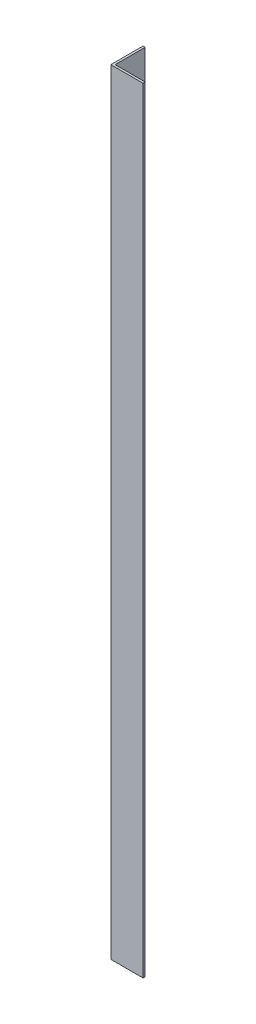
ISO-10303-21;
HEADER;
FILE_DESCRIPTION(('STEP AP214'),'2;1');
FILE_NAME('part.step','',(''),(''),'','','');
FILE_SCHEMA(('AUTOMOTIVE_DESIGN { 1 0 10303 214 1 1 1 1 }'));
ENDSEC;
DATA;
#1=APPLICATION_CONTEXT('core data for automotive mechanical design processes');
#2=APPLICATION_PROTOCOL_DEFINITION('international standard','automotive_design',2000,#1);
#3=PRODUCT_CONTEXT('',#1,'mechanical');
#4=PRODUCT('Part','Part','',(#3));
#5=PRODUCT_RELATED_PRODUCT_CATEGORY('part','',(#4));
#6=PRODUCT_DEFINITION_FORMATION('','',#4);
#7=PRODUCT_DEFINITION_CONTEXT('part definition',#1,'design');
#8=PRODUCT_DEFINITION('design','',#6,#7);
#9=PRODUCT_DEFINITION_SHAPE('','',#8);
#10=(LENGTH_UNIT() NAMED_UNIT(*) SI_UNIT(.MILLI.,.METRE.));
#11=(NAMED_UNIT(*) PLANE_ANGLE_UNIT() SI_UNIT($,.RADIAN.));
#12=(NAMED_UNIT(*) SI_UNIT($,.STERADIAN.) SOLID_ANGLE_UNIT());
#13=UNCERTAINTY_MEASURE_WITH_UNIT(LENGTH_MEASURE(1.E-05),#10,'distance_accuracy_value','');
#14=(GEOMETRIC_REPRESENTATION_CONTEXT(3) GLOBAL_UNCERTAINTY_ASSIGNED_CONTEXT((#13)) GLOBAL_UNIT_ASSIGNED_CONTEXT((#10,
#11,#12)) REPRESENTATION_CONTEXT('',''));
#15=CARTESIAN_POINT('',(0.,0.,0.));
#16=DIRECTION('',(0.,0.,1.));
#17=DIRECTION('',(1.,0.,0.));
#18=AXIS2_PLACEMENT_3D('',#15,#16,#17);
#19=CARTESIAN_POINT('',(15.,360.,0.));
#20=DIRECTION('',(0.,0.,-1.));
#21=DIRECTION('',(-1.,0.,0.));
#22=AXIS2_PLACEMENT_3D('',#19,#20,#21);
#23=PLANE('',#22);
#24=DIRECTION('',(1.,0.,0.));
#25=VECTOR('',#24,1.);
#26=CARTESIAN_POINT('',(15.,0.,0.));
#27=LINE('',#26,#25);
#28=CARTESIAN_POINT('',(0.,0.,0.));
#29=VERTEX_POINT('',#28);
#30=CARTESIAN_POINT('',(15.,0.,0.));
#31=VERTEX_POINT('',#30);
#32=EDGE_CURVE('E121',#29,#31,#27,.T.);
#33=ORIENTED_EDGE('',*,*,#32,.T.);
#34=DIRECTION('',(0.,-1.,0.));
#35=VECTOR('',#34,1.);
#36=CARTESIAN_POINT('',(15.,360.,0.));
#37=LINE('',#36,#35);
#38=CARTESIAN_POINT('',(15.,360.,0.));
#39=VERTEX_POINT('',#38);
#40=EDGE_CURVE('E11',#39,#31,#37,.T.);
#41=ORIENTED_EDGE('',*,*,#40,.F.);
#42=DIRECTION('',(1.,0.,0.));
#43=VECTOR('',#42,1.);
#44=CARTESIAN_POINT('',(15.,360.,0.));
#45=LINE('',#44,#43);
#46=CARTESIAN_POINT('',(0.,360.,0.));
#47=VERTEX_POINT('',#46);
#48=EDGE_CURVE('E131',#47,#39,#45,.T.);
#49=ORIENTED_EDGE('',*,*,#48,.F.);
#50=DIRECTION('',(0.,-1.,0.));
#51=VECTOR('',#50,1.);
#52=CARTESIAN_POINT('',(0.,360.,0.));
#53=LINE('',#52,#51);
#54=EDGE_CURVE('E117',#47,#29,#53,.T.);
#55=ORIENTED_EDGE('',*,*,#54,.T.);
#56=EDGE_LOOP('',(#33,#41,#49,#55));
#57=FACE_BOUND('',#56,.T.);
#58=ADVANCED_FACE('F37',(#57),#23,.F.);
#59=CARTESIAN_POINT('',(15.,360.,-0.999999999999998));
#60=DIRECTION('',(-1.,0.,0.));
#61=DIRECTION('',(0.,0.,1.));
#62=AXIS2_PLACEMENT_3D('',#59,#60,#61);
#63=PLANE('',#62);
#64=DIRECTION('',(0.,0.,-1.));
#65=VECTOR('',#64,1.);
#66=CARTESIAN_POINT('',(15.,0.,-0.999999999999998));
#67=LINE('',#66,#65);
#68=CARTESIAN_POINT('',(15.,0.,-0.999999999999998));
#69=VERTEX_POINT('',#68);
#70=EDGE_CURVE('E124',#31,#69,#67,.T.);
#71=ORIENTED_EDGE('',*,*,#70,.T.);
#72=DIRECTION('',(0.,-1.,0.));
#73=VECTOR('',#72,1.);
#74=CARTESIAN_POINT('',(15.,360.,-0.999999999999998));
#75=LINE('',#74,#73);
#76=CARTESIAN_POINT('',(15.,360.,-0.999999999999998));
#77=VERTEX_POINT('',#76);
#78=EDGE_CURVE('E45',#77,#69,#75,.T.);
#79=ORIENTED_EDGE('',*,*,#78,.F.);
#80=DIRECTION('',(0.,0.,-1.));
#81=VECTOR('',#80,1.);
#82=CARTESIAN_POINT('',(15.,360.,-0.999999999999998));
#83=LINE('',#82,#81);
#84=EDGE_CURVE('E90',#39,#77,#83,.T.);
#85=ORIENTED_EDGE('',*,*,#84,.F.);
#86=ORIENTED_EDGE('',*,*,#40,.T.);
#87=EDGE_LOOP('',(#71,#79,#85,#86));
#88=FACE_BOUND('',#87,.T.);
#89=ADVANCED_FACE('F155',(#88),#63,.F.);
#90=CARTESIAN_POINT('',(1.,360.,-0.999999999999997));
#91=DIRECTION('',(0.,0.,1.));
#92=DIRECTION('',(1.,0.,0.));
#93=AXIS2_PLACEMENT_3D('',#90,#91,#92);
#94=PLANE('',#93);
#95=DIRECTION('',(-1.,0.,0.));
#96=VECTOR('',#95,1.);
#97=CARTESIAN_POINT('',(1.,0.,-0.999999999999997));
#98=LINE('',#97,#96);
#99=CARTESIAN_POINT('',(1.,0.,-0.999999999999997));
#100=VERTEX_POINT('',#99);
#101=EDGE_CURVE('E126',#69,#100,#98,.T.);
#102=ORIENTED_EDGE('',*,*,#101,.T.);
#103=DIRECTION('',(0.,-1.,0.));
#104=VECTOR('',#103,1.);
#105=CARTESIAN_POINT('',(1.,360.,-0.999999999999997));
#106=LINE('',#105,#104);
#107=CARTESIAN_POINT('',(1.,360.,-0.999999999999997));
#108=VERTEX_POINT('',#107);
#109=EDGE_CURVE('E112',#108,#100,#106,.T.);
#110=ORIENTED_EDGE('',*,*,#109,.F.);
#111=DIRECTION('',(-1.,0.,0.));
#112=VECTOR('',#111,1.);
#113=CARTESIAN_POINT('',(1.,360.,-0.999999999999997));
#114=LINE('',#113,#112);
#115=EDGE_CURVE('E103',#77,#108,#114,.T.);
#116=ORIENTED_EDGE('',*,*,#115,.F.);
#117=ORIENTED_EDGE('',*,*,#78,.T.);
#118=EDGE_LOOP('',(#102,#110,#116,#117));
#119=FACE_BOUND('',#118,.T.);
#120=ADVANCED_FACE('F137',(#119),#94,.F.);
#121=CARTESIAN_POINT('',(0.999999999999998,360.,-15.));
#122=DIRECTION('',(-1.,0.,0.));
#123=DIRECTION('',(0.,0.,1.));
#124=AXIS2_PLACEMENT_3D('',#121,#122,#123);
#125=PLANE('',#124);
#126=DIRECTION('',(0.,0.,-1.));
#127=VECTOR('',#126,1.);
#128=CARTESIAN_POINT('',(0.999999999999998,0.,-15.));
#129=LINE('',#128,#127);
#130=CARTESIAN_POINT('',(0.999999999999998,0.,-15.));
#131=VERTEX_POINT('',#130);
#132=EDGE_CURVE('E111',#100,#131,#129,.T.);
#133=ORIENTED_EDGE('',*,*,#132,.T.);
#134=DIRECTION('',(0.,-1.,0.));
#135=VECTOR('',#134,1.);
#136=CARTESIAN_POINT('',(0.999999999999998,360.,-15.));
#137=LINE('',#136,#135);
#138=CARTESIAN_POINT('',(0.999999999999998,360.,-15.));
#139=VERTEX_POINT('',#138);
#140=EDGE_CURVE('E108',#139,#131,#137,.T.);
#141=ORIENTED_EDGE('',*,*,#140,.F.);
#142=DIRECTION('',(0.,0.,-1.));
#143=VECTOR('',#142,1.);
#144=CARTESIAN_POINT('',(0.999999999999998,360.,-15.));
#145=LINE('',#144,#143);
#146=EDGE_CURVE('E97',#108,#139,#145,.T.);
#147=ORIENTED_EDGE('',*,*,#146,.F.);
#148=ORIENTED_EDGE('',*,*,#109,.T.);
#149=EDGE_LOOP('',(#133,#141,#147,#148));
#150=FACE_BOUND('',#149,.T.);
#151=ADVANCED_FACE('F109',(#150),#125,.F.);
#152=CARTESIAN_POINT('',(0.,360.,-15.));
#153=DIRECTION('',(0.,0.,1.));
#154=DIRECTION('',(1.,0.,0.));
#155=AXIS2_PLACEMENT_3D('',#152,#153,#154);
#156=PLANE('',#155);
#157=DIRECTION('',(-1.,0.,0.));
#158=VECTOR('',#157,1.);
#159=CARTESIAN_POINT('',(0.,0.,-15.));
#160=LINE('',#159,#158);
#161=CARTESIAN_POINT('',(0.,0.,-15.));
#162=VERTEX_POINT('',#161);
#163=EDGE_CURVE('E76',#131,#162,#160,.T.);
#164=ORIENTED_EDGE('',*,*,#163,.T.);
#165=DIRECTION('',(0.,-1.,0.));
#166=VECTOR('',#165,1.);
#167=CARTESIAN_POINT('',(0.,360.,-15.));
#168=LINE('',#167,#166);
#169=CARTESIAN_POINT('',(0.,360.,-15.));
#170=VERTEX_POINT('',#169);
#171=EDGE_CURVE('E113',#170,#162,#168,.T.);
#172=ORIENTED_EDGE('',*,*,#171,.F.);
#173=DIRECTION('',(-1.,0.,0.));
#174=VECTOR('',#173,1.);
#175=CARTESIAN_POINT('',(0.,360.,-15.));
#176=LINE('',#175,#174);
#177=EDGE_CURVE('E101',#139,#170,#176,.T.);
#178=ORIENTED_EDGE('',*,*,#177,.F.);
#179=ORIENTED_EDGE('',*,*,#140,.T.);
#180=EDGE_LOOP('',(#164,#172,#178,#179));
#181=FACE_BOUND('',#180,.T.);
#182=ADVANCED_FACE('F115',(#181),#156,.F.);
#183=CARTESIAN_POINT('',(0.,360.,0.));
#184=DIRECTION('',(1.,0.,0.));
#185=DIRECTION('',(0.,0.,-1.));
#186=AXIS2_PLACEMENT_3D('',#183,#184,#185);
#187=PLANE('',#186);
#188=DIRECTION('',(0.,0.,1.));
#189=VECTOR('',#188,1.);
#190=CARTESIAN_POINT('',(0.,0.,0.));
#191=LINE('',#190,#189);
#192=EDGE_CURVE('E82',#162,#29,#191,.T.);
#193=ORIENTED_EDGE('',*,*,#192,.T.);
#194=ORIENTED_EDGE('',*,*,#54,.F.);
#195=DIRECTION('',(0.,0.,1.));
#196=VECTOR('',#195,1.);
#197=CARTESIAN_POINT('',(0.,360.,0.));
#198=LINE('',#197,#196);
#199=EDGE_CURVE('E53',#170,#47,#198,.T.);
#200=ORIENTED_EDGE('',*,*,#199,.F.);
#201=ORIENTED_EDGE('',*,*,#171,.T.);
#202=EDGE_LOOP('',(#193,#194,#200,#201));
#203=FACE_BOUND('',#202,.T.);
#204=ADVANCED_FACE('F144',(#203),#187,.F.);
#205=CARTESIAN_POINT('',(0.,360.,0.));
#206=DIRECTION('',(0.,-1.,0.));
#207=DIRECTION('',(0.,0.,-1.));
#208=AXIS2_PLACEMENT_3D('',#205,#206,#207);
#209=PLANE('',#208);
#210=ORIENTED_EDGE('',*,*,#48,.T.);
#211=ORIENTED_EDGE('',*,*,#84,.T.);
#212=ORIENTED_EDGE('',*,*,#115,.T.);
#213=ORIENTED_EDGE('',*,*,#146,.T.);
#214=ORIENTED_EDGE('',*,*,#177,.T.);
#215=ORIENTED_EDGE('',*,*,#199,.T.);
#216=EDGE_LOOP('',(#210,#211,#212,#213,#214,#215));
#217=FACE_BOUND('',#216,.T.);
#218=ADVANCED_FACE('F99',(#217),#209,.F.);
#219=CARTESIAN_POINT('',(0.,0.,0.));
#220=DIRECTION('',(0.,-1.,0.));
#221=DIRECTION('',(0.,0.,-1.));
#222=AXIS2_PLACEMENT_3D('',#219,#220,#221);
#223=PLANE('',#222);
#224=ORIENTED_EDGE('',*,*,#32,.F.);
#225=ORIENTED_EDGE('',*,*,#192,.F.);
#226=ORIENTED_EDGE('',*,*,#163,.F.);
#227=ORIENTED_EDGE('',*,*,#132,.F.);
#228=ORIENTED_EDGE('',*,*,#101,.F.);
#229=ORIENTED_EDGE('',*,*,#70,.F.);
#230=EDGE_LOOP('',(#224,#225,#226,#227,#228,#229));
#231=FACE_BOUND('',#230,.T.);
#232=ADVANCED_FACE('F140',(#231),#223,.T.);
#233=CLOSED_SHELL('',(#58,#89,#120,#151,#182,#204,#218,#232));
#234=MANIFOLD_SOLID_BREP('B2',#233);
#235=ADVANCED_BREP_SHAPE_REPRESENTATION('',(#18,#234),#14);
#236=SHAPE_DEFINITION_REPRESENTATION(#9,#235);
ENDSEC;
END-ISO-10303-21;
